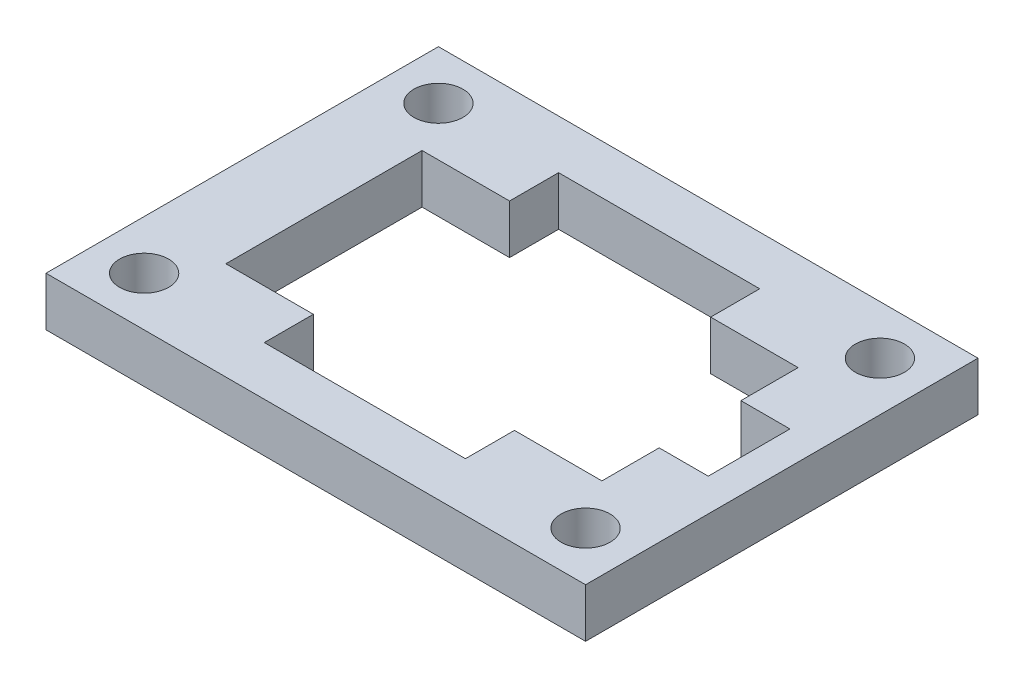
ISO-10303-21;
HEADER;
FILE_DESCRIPTION(('STEP AP214'),'2;1');
FILE_NAME('part.step','',(''),(''),'','','');
FILE_SCHEMA(('AUTOMOTIVE_DESIGN { 1 0 10303 214 1 1 1 1 }'));
ENDSEC;
DATA;
#1=APPLICATION_CONTEXT('core data for automotive mechanical design processes');
#2=APPLICATION_PROTOCOL_DEFINITION('international standard','automotive_design',2000,#1);
#3=PRODUCT_CONTEXT('',#1,'mechanical');
#4=PRODUCT('Part','Part','',(#3));
#5=PRODUCT_RELATED_PRODUCT_CATEGORY('part','',(#4));
#6=PRODUCT_DEFINITION_FORMATION('','',#4);
#7=PRODUCT_DEFINITION_CONTEXT('part definition',#1,'design');
#8=PRODUCT_DEFINITION('design','',#6,#7);
#9=PRODUCT_DEFINITION_SHAPE('','',#8);
#10=(LENGTH_UNIT() NAMED_UNIT(*) SI_UNIT(.MILLI.,.METRE.));
#11=(NAMED_UNIT(*) PLANE_ANGLE_UNIT() SI_UNIT($,.RADIAN.));
#12=(NAMED_UNIT(*) SI_UNIT($,.STERADIAN.) SOLID_ANGLE_UNIT());
#13=UNCERTAINTY_MEASURE_WITH_UNIT(LENGTH_MEASURE(1.E-05),#10,'distance_accuracy_value','');
#14=(GEOMETRIC_REPRESENTATION_CONTEXT(3) GLOBAL_UNCERTAINTY_ASSIGNED_CONTEXT((#13)) GLOBAL_UNIT_ASSIGNED_CONTEXT((#10,
#11,#12)) REPRESENTATION_CONTEXT('',''));
#15=CARTESIAN_POINT('',(0.,0.,0.));
#16=DIRECTION('',(0.,0.,1.));
#17=DIRECTION('',(1.,0.,0.));
#18=AXIS2_PLACEMENT_3D('',#15,#16,#17);
#19=CARTESIAN_POINT('',(0.,3.,0.));
#20=DIRECTION('',(0.,-1.,0.));
#21=DIRECTION('',(0.,0.,-1.));
#22=AXIS2_PLACEMENT_3D('',#19,#20,#21);
#23=PLANE('',#22);
#24=CARTESIAN_POINT('',(3.,3.,-21.));
#25=DIRECTION('',(0.,1.,0.));
#26=DIRECTION('',(0.,0.,1.));
#27=AXIS2_PLACEMENT_3D('',#24,#25,#26);
#28=CIRCLE('',#27,1.5);
#29=CARTESIAN_POINT('',(3.,3.,-19.5));
#30=VERTEX_POINT('',#29);
#31=EDGE_CURVE('E338',#30,#30,#28,.T.);
#32=ORIENTED_EDGE('',*,*,#31,.F.);
#33=EDGE_LOOP('',(#32));
#34=FACE_BOUND('',#33,.T.);
#35=CARTESIAN_POINT('',(3.,3.,-3.));
#36=DIRECTION('',(0.,1.,0.));
#37=DIRECTION('',(0.,0.,1.));
#38=AXIS2_PLACEMENT_3D('',#35,#36,#37);
#39=CIRCLE('',#38,1.5);
#40=CARTESIAN_POINT('',(3.,3.,-1.5));
#41=VERTEX_POINT('',#40);
#42=EDGE_CURVE('E403',#41,#41,#39,.T.);
#43=ORIENTED_EDGE('',*,*,#42,.F.);
#44=EDGE_LOOP('',(#43));
#45=FACE_BOUND('',#44,.T.);
#46=DIRECTION('',(0.,0.,1.));
#47=VECTOR('',#46,1.);
#48=CARTESIAN_POINT('',(0.,3.,0.));
#49=LINE('',#48,#47);
#50=CARTESIAN_POINT('',(0.,3.,-24.));
#51=VERTEX_POINT('',#50);
#52=CARTESIAN_POINT('',(0.,3.,0.));
#53=VERTEX_POINT('',#52);
#54=EDGE_CURVE('E417',#51,#53,#49,.T.);
#55=ORIENTED_EDGE('',*,*,#54,.T.);
#56=DIRECTION('',(1.,0.,0.));
#57=VECTOR('',#56,1.);
#58=CARTESIAN_POINT('',(0.,3.,0.));
#59=LINE('',#58,#57);
#60=CARTESIAN_POINT('',(33.,3.,0.));
#61=VERTEX_POINT('',#60);
#62=EDGE_CURVE('E420',#53,#61,#59,.T.);
#63=ORIENTED_EDGE('',*,*,#62,.T.);
#64=DIRECTION('',(0.,0.,-1.));
#65=VECTOR('',#64,1.);
#66=CARTESIAN_POINT('',(33.,3.,0.));
#67=LINE('',#66,#65);
#68=CARTESIAN_POINT('',(33.,3.,-24.));
#69=VERTEX_POINT('',#68);
#70=EDGE_CURVE('E423',#61,#69,#67,.T.);
#71=ORIENTED_EDGE('',*,*,#70,.T.);
#72=DIRECTION('',(-1.,0.,0.));
#73=VECTOR('',#72,1.);
#74=CARTESIAN_POINT('',(0.,3.,-24.));
#75=LINE('',#74,#73);
#76=EDGE_CURVE('E425',#69,#51,#75,.T.);
#77=ORIENTED_EDGE('',*,*,#76,.T.);
#78=EDGE_LOOP('',(#55,#63,#71,#77));
#79=FACE_BOUND('',#78,.T.);
#80=CARTESIAN_POINT('',(30.,3.,-21.));
#81=DIRECTION('',(0.,1.,0.));
#82=DIRECTION('',(0.,0.,1.));
#83=AXIS2_PLACEMENT_3D('',#80,#81,#82);
#84=CIRCLE('',#83,1.5);
#85=CARTESIAN_POINT('',(30.,3.,-19.5));
#86=VERTEX_POINT('',#85);
#87=EDGE_CURVE('E389',#86,#86,#84,.T.);
#88=ORIENTED_EDGE('',*,*,#87,.F.);
#89=EDGE_LOOP('',(#88));
#90=FACE_BOUND('',#89,.T.);
#91=CARTESIAN_POINT('',(30.,3.,-3.));
#92=DIRECTION('',(0.,1.,0.));
#93=DIRECTION('',(0.,0.,1.));
#94=AXIS2_PLACEMENT_3D('',#91,#92,#93);
#95=CIRCLE('',#94,1.5);
#96=CARTESIAN_POINT('',(30.,3.,-1.5));
#97=VERTEX_POINT('',#96);
#98=EDGE_CURVE('E345',#97,#97,#95,.T.);
#99=ORIENTED_EDGE('',*,*,#98,.F.);
#100=EDGE_LOOP('',(#99));
#101=FACE_BOUND('',#100,.T.);
#102=DIRECTION('',(1.,0.,0.));
#103=VECTOR('',#102,1.);
#104=CARTESIAN_POINT('',(0.,3.,-21.));
#105=LINE('',#104,#103);
#106=CARTESIAN_POINT('',(10.35,3.,-21.));
#107=VERTEX_POINT('',#106);
#108=CARTESIAN_POINT('',(22.65,3.,-21.));
#109=VERTEX_POINT('',#108);
#110=EDGE_CURVE('E371',#107,#109,#105,.T.);
#111=ORIENTED_EDGE('',*,*,#110,.T.);
#112=DIRECTION('',(0.,0.,-1.));
#113=VECTOR('',#112,1.);
#114=CARTESIAN_POINT('',(22.65,3.,-18.));
#115=LINE('',#114,#113);
#116=CARTESIAN_POINT('',(22.65,3.,-18.));
#117=VERTEX_POINT('',#116);
#118=EDGE_CURVE('E315',#117,#109,#115,.T.);
#119=ORIENTED_EDGE('',*,*,#118,.F.);
#120=DIRECTION('',(1.,0.,0.));
#121=VECTOR('',#120,1.);
#122=CARTESIAN_POINT('',(0.,3.,-18.));
#123=LINE('',#122,#121);
#124=CARTESIAN_POINT('',(28.,3.,-18.));
#125=VERTEX_POINT('',#124);
#126=EDGE_CURVE('E368',#117,#125,#123,.T.);
#127=ORIENTED_EDGE('',*,*,#126,.T.);
#128=DIRECTION('',(0.,0.,1.));
#129=VECTOR('',#128,1.);
#130=CARTESIAN_POINT('',(28.,3.,0.));
#131=LINE('',#130,#129);
#132=CARTESIAN_POINT('',(28.,3.,-14.5));
#133=VERTEX_POINT('',#132);
#134=EDGE_CURVE('E344',#125,#133,#131,.T.);
#135=ORIENTED_EDGE('',*,*,#134,.T.);
#136=DIRECTION('',(1.,0.,0.));
#137=VECTOR('',#136,1.);
#138=CARTESIAN_POINT('',(0.,3.,-14.5));
#139=LINE('',#138,#137);
#140=CARTESIAN_POINT('',(31.,3.,-14.5));
#141=VERTEX_POINT('',#140);
#142=EDGE_CURVE('E352',#133,#141,#139,.T.);
#143=ORIENTED_EDGE('',*,*,#142,.T.);
#144=DIRECTION('',(0.,0.,-1.));
#145=VECTOR('',#144,1.);
#146=CARTESIAN_POINT('',(31.,3.,-14.5));
#147=LINE('',#146,#145);
#148=CARTESIAN_POINT('',(31.,3.,-9.5));
#149=VERTEX_POINT('',#148);
#150=EDGE_CURVE('E306',#149,#141,#147,.T.);
#151=ORIENTED_EDGE('',*,*,#150,.F.);
#152=DIRECTION('',(1.,0.,0.));
#153=VECTOR('',#152,1.);
#154=CARTESIAN_POINT('',(0.,3.,-9.5));
#155=LINE('',#154,#153);
#156=CARTESIAN_POINT('',(28.,3.,-9.5));
#157=VERTEX_POINT('',#156);
#158=EDGE_CURVE('E383',#157,#149,#155,.T.);
#159=ORIENTED_EDGE('',*,*,#158,.F.);
#160=CARTESIAN_POINT('',(28.,3.,-6.));
#161=VERTEX_POINT('',#160);
#162=EDGE_CURVE('E369',#157,#161,#131,.T.);
#163=ORIENTED_EDGE('',*,*,#162,.T.);
#164=DIRECTION('',(1.,0.,0.));
#165=VECTOR('',#164,1.);
#166=CARTESIAN_POINT('',(0.,3.,-6.));
#167=LINE('',#166,#165);
#168=CARTESIAN_POINT('',(22.65,3.,-6.));
#169=VERTEX_POINT('',#168);
#170=EDGE_CURVE('E381',#169,#161,#167,.T.);
#171=ORIENTED_EDGE('',*,*,#170,.F.);
#172=DIRECTION('',(0.,0.,-1.));
#173=VECTOR('',#172,1.);
#174=CARTESIAN_POINT('',(22.65,3.,-6.));
#175=LINE('',#174,#173);
#176=CARTESIAN_POINT('',(22.65,3.,-3.));
#177=VERTEX_POINT('',#176);
#178=EDGE_CURVE('E289',#177,#169,#175,.T.);
#179=ORIENTED_EDGE('',*,*,#178,.F.);
#180=DIRECTION('',(1.,0.,0.));
#181=VECTOR('',#180,1.);
#182=CARTESIAN_POINT('',(0.,3.,-3.));
#183=LINE('',#182,#181);
#184=CARTESIAN_POINT('',(10.35,3.,-3.));
#185=VERTEX_POINT('',#184);
#186=EDGE_CURVE('E380',#185,#177,#183,.T.);
#187=ORIENTED_EDGE('',*,*,#186,.F.);
#188=DIRECTION('',(0.,0.,1.));
#189=VECTOR('',#188,1.);
#190=CARTESIAN_POINT('',(10.35,3.,-6.));
#191=LINE('',#190,#189);
#192=CARTESIAN_POINT('',(10.35,3.,-6.));
#193=VERTEX_POINT('',#192);
#194=EDGE_CURVE('E288',#193,#185,#191,.T.);
#195=ORIENTED_EDGE('',*,*,#194,.F.);
#196=CARTESIAN_POINT('',(5.,3.,-6.));
#197=VERTEX_POINT('',#196);
#198=EDGE_CURVE('E377',#197,#193,#167,.T.);
#199=ORIENTED_EDGE('',*,*,#198,.F.);
#200=DIRECTION('',(0.,0.,1.));
#201=VECTOR('',#200,1.);
#202=CARTESIAN_POINT('',(5.,3.,0.));
#203=LINE('',#202,#201);
#204=CARTESIAN_POINT('',(5.,3.,-18.));
#205=VERTEX_POINT('',#204);
#206=EDGE_CURVE('E374',#205,#197,#203,.T.);
#207=ORIENTED_EDGE('',*,*,#206,.F.);
#208=CARTESIAN_POINT('',(10.35,3.,-18.));
#209=VERTEX_POINT('',#208);
#210=EDGE_CURVE('E372',#205,#209,#123,.T.);
#211=ORIENTED_EDGE('',*,*,#210,.T.);
#212=DIRECTION('',(0.,0.,1.));
#213=VECTOR('',#212,1.);
#214=CARTESIAN_POINT('',(10.35,3.,-18.));
#215=LINE('',#214,#213);
#216=EDGE_CURVE('E322',#107,#209,#215,.T.);
#217=ORIENTED_EDGE('',*,*,#216,.F.);
#218=EDGE_LOOP('',(#111,#119,#127,#135,#143,#151,#159,#163,#171,#179,#187,#195,#199,#207,#211,#217));
#219=FACE_BOUND('',#218,.T.);
#220=ADVANCED_FACE('F135',(#34,#45,#79,#90,#101,#219),#23,.F.);
#221=CARTESIAN_POINT('',(0.,0.,0.));
#222=DIRECTION('',(0.,-1.,0.));
#223=DIRECTION('',(0.,0.,-1.));
#224=AXIS2_PLACEMENT_3D('',#221,#222,#223);
#225=PLANE('',#224);
#226=DIRECTION('',(0.,0.,-1.));
#227=VECTOR('',#226,1.);
#228=CARTESIAN_POINT('',(22.65,0.,-18.));
#229=LINE('',#228,#227);
#230=CARTESIAN_POINT('',(22.65,0.,-18.));
#231=VERTEX_POINT('',#230);
#232=CARTESIAN_POINT('',(22.65,0.,-21.));
#233=VERTEX_POINT('',#232);
#234=EDGE_CURVE('E158',#231,#233,#229,.T.);
#235=ORIENTED_EDGE('',*,*,#234,.T.);
#236=DIRECTION('',(1.,0.,0.));
#237=VECTOR('',#236,1.);
#238=CARTESIAN_POINT('',(0.,0.,-21.));
#239=LINE('',#238,#237);
#240=CARTESIAN_POINT('',(10.35,0.,-21.));
#241=VERTEX_POINT('',#240);
#242=EDGE_CURVE('E355',#241,#233,#239,.T.);
#243=ORIENTED_EDGE('',*,*,#242,.F.);
#244=DIRECTION('',(0.,0.,1.));
#245=VECTOR('',#244,1.);
#246=CARTESIAN_POINT('',(10.35,0.,-18.));
#247=LINE('',#246,#245);
#248=CARTESIAN_POINT('',(10.35,0.,-18.));
#249=VERTEX_POINT('',#248);
#250=EDGE_CURVE('E330',#241,#249,#247,.T.);
#251=ORIENTED_EDGE('',*,*,#250,.T.);
#252=DIRECTION('',(1.,0.,0.));
#253=VECTOR('',#252,1.);
#254=CARTESIAN_POINT('',(0.,0.,-18.));
#255=LINE('',#254,#253);
#256=CARTESIAN_POINT('',(5.,0.,-18.));
#257=VERTEX_POINT('',#256);
#258=EDGE_CURVE('E356',#257,#249,#255,.T.);
#259=ORIENTED_EDGE('',*,*,#258,.F.);
#260=DIRECTION('',(0.,0.,1.));
#261=VECTOR('',#260,1.);
#262=CARTESIAN_POINT('',(5.,0.,0.));
#263=LINE('',#262,#261);
#264=CARTESIAN_POINT('',(5.,0.,-6.));
#265=VERTEX_POINT('',#264);
#266=EDGE_CURVE('E358',#257,#265,#263,.T.);
#267=ORIENTED_EDGE('',*,*,#266,.T.);
#268=DIRECTION('',(1.,0.,0.));
#269=VECTOR('',#268,1.);
#270=CARTESIAN_POINT('',(0.,0.,-6.));
#271=LINE('',#270,#269);
#272=CARTESIAN_POINT('',(10.35,0.,-6.));
#273=VERTEX_POINT('',#272);
#274=EDGE_CURVE('E284',#265,#273,#271,.T.);
#275=ORIENTED_EDGE('',*,*,#274,.T.);
#276=DIRECTION('',(0.,0.,1.));
#277=VECTOR('',#276,1.);
#278=CARTESIAN_POINT('',(10.35,0.,-6.));
#279=LINE('',#278,#277);
#280=CARTESIAN_POINT('',(10.35,0.,-3.));
#281=VERTEX_POINT('',#280);
#282=EDGE_CURVE('E150',#273,#281,#279,.T.);
#283=ORIENTED_EDGE('',*,*,#282,.T.);
#284=DIRECTION('',(1.,0.,0.));
#285=VECTOR('',#284,1.);
#286=CARTESIAN_POINT('',(0.,0.,-3.));
#287=LINE('',#286,#285);
#288=CARTESIAN_POINT('',(22.65,0.,-3.));
#289=VERTEX_POINT('',#288);
#290=EDGE_CURVE('E274',#281,#289,#287,.T.);
#291=ORIENTED_EDGE('',*,*,#290,.T.);
#292=DIRECTION('',(0.,0.,-1.));
#293=VECTOR('',#292,1.);
#294=CARTESIAN_POINT('',(22.65,0.,-6.));
#295=LINE('',#294,#293);
#296=CARTESIAN_POINT('',(22.65,0.,-6.));
#297=VERTEX_POINT('',#296);
#298=EDGE_CURVE('E324',#289,#297,#295,.T.);
#299=ORIENTED_EDGE('',*,*,#298,.T.);
#300=CARTESIAN_POINT('',(28.,0.,-6.));
#301=VERTEX_POINT('',#300);
#302=EDGE_CURVE('E283',#297,#301,#271,.T.);
#303=ORIENTED_EDGE('',*,*,#302,.T.);
#304=DIRECTION('',(0.,0.,1.));
#305=VECTOR('',#304,1.);
#306=CARTESIAN_POINT('',(28.,0.,0.));
#307=LINE('',#306,#305);
#308=CARTESIAN_POINT('',(28.,0.,-9.5));
#309=VERTEX_POINT('',#308);
#310=EDGE_CURVE('E353',#309,#301,#307,.T.);
#311=ORIENTED_EDGE('',*,*,#310,.F.);
#312=DIRECTION('',(1.,0.,0.));
#313=VECTOR('',#312,1.);
#314=CARTESIAN_POINT('',(0.,0.,-9.5));
#315=LINE('',#314,#313);
#316=CARTESIAN_POINT('',(31.,0.,-9.5));
#317=VERTEX_POINT('',#316);
#318=EDGE_CURVE('E361',#309,#317,#315,.T.);
#319=ORIENTED_EDGE('',*,*,#318,.T.);
#320=DIRECTION('',(0.,0.,-1.));
#321=VECTOR('',#320,1.);
#322=CARTESIAN_POINT('',(31.,0.,-14.5));
#323=LINE('',#322,#321);
#324=CARTESIAN_POINT('',(31.,0.,-14.5));
#325=VERTEX_POINT('',#324);
#326=EDGE_CURVE('E302',#317,#325,#323,.T.);
#327=ORIENTED_EDGE('',*,*,#326,.T.);
#328=DIRECTION('',(1.,0.,0.));
#329=VECTOR('',#328,1.);
#330=CARTESIAN_POINT('',(0.,0.,-14.5));
#331=LINE('',#330,#329);
#332=CARTESIAN_POINT('',(28.,0.,-14.5));
#333=VERTEX_POINT('',#332);
#334=EDGE_CURVE('E363',#333,#325,#331,.T.);
#335=ORIENTED_EDGE('',*,*,#334,.F.);
#336=CARTESIAN_POINT('',(28.,0.,-18.));
#337=VERTEX_POINT('',#336);
#338=EDGE_CURVE('E349',#337,#333,#307,.T.);
#339=ORIENTED_EDGE('',*,*,#338,.F.);
#340=EDGE_CURVE('E351',#231,#337,#255,.T.);
#341=ORIENTED_EDGE('',*,*,#340,.F.);
#342=EDGE_LOOP('',(#235,#243,#251,#259,#267,#275,#283,#291,#299,#303,#311,#319,#327,#335,#339,#341));
#343=FACE_BOUND('',#342,.T.);
#344=CARTESIAN_POINT('',(3.,0.,-21.));
#345=DIRECTION('',(0.,1.,0.));
#346=DIRECTION('',(0.,0.,1.));
#347=AXIS2_PLACEMENT_3D('',#344,#345,#346);
#348=CIRCLE('',#347,1.5);
#349=CARTESIAN_POINT('',(3.,0.,-19.5));
#350=VERTEX_POINT('',#349);
#351=EDGE_CURVE('E406',#350,#350,#348,.T.);
#352=ORIENTED_EDGE('',*,*,#351,.T.);
#353=EDGE_LOOP('',(#352));
#354=FACE_BOUND('',#353,.T.);
#355=CARTESIAN_POINT('',(3.,0.,-3.));
#356=DIRECTION('',(0.,1.,0.));
#357=DIRECTION('',(0.,0.,1.));
#358=AXIS2_PLACEMENT_3D('',#355,#356,#357);
#359=CIRCLE('',#358,1.5);
#360=CARTESIAN_POINT('',(3.,0.,-1.5));
#361=VERTEX_POINT('',#360);
#362=EDGE_CURVE('E348',#361,#361,#359,.T.);
#363=ORIENTED_EDGE('',*,*,#362,.T.);
#364=EDGE_LOOP('',(#363));
#365=FACE_BOUND('',#364,.T.);
#366=CARTESIAN_POINT('',(30.,0.,-3.));
#367=DIRECTION('',(0.,1.,0.));
#368=DIRECTION('',(0.,0.,1.));
#369=AXIS2_PLACEMENT_3D('',#366,#367,#368);
#370=CIRCLE('',#369,1.5);
#371=CARTESIAN_POINT('',(30.,0.,-1.5));
#372=VERTEX_POINT('',#371);
#373=EDGE_CURVE('E341',#372,#372,#370,.T.);
#374=ORIENTED_EDGE('',*,*,#373,.T.);
#375=EDGE_LOOP('',(#374));
#376=FACE_BOUND('',#375,.T.);
#377=CARTESIAN_POINT('',(30.,0.,-21.));
#378=DIRECTION('',(0.,1.,0.));
#379=DIRECTION('',(0.,0.,1.));
#380=AXIS2_PLACEMENT_3D('',#377,#378,#379);
#381=CIRCLE('',#380,1.5);
#382=CARTESIAN_POINT('',(30.,0.,-19.5));
#383=VERTEX_POINT('',#382);
#384=EDGE_CURVE('E411',#383,#383,#381,.T.);
#385=ORIENTED_EDGE('',*,*,#384,.T.);
#386=EDGE_LOOP('',(#385));
#387=FACE_BOUND('',#386,.T.);
#388=DIRECTION('',(0.,0.,1.));
#389=VECTOR('',#388,1.);
#390=CARTESIAN_POINT('',(0.,0.,0.));
#391=LINE('',#390,#389);
#392=CARTESIAN_POINT('',(0.,0.,-24.));
#393=VERTEX_POINT('',#392);
#394=CARTESIAN_POINT('',(0.,0.,0.));
#395=VERTEX_POINT('',#394);
#396=EDGE_CURVE('E414',#393,#395,#391,.T.);
#397=ORIENTED_EDGE('',*,*,#396,.F.);
#398=DIRECTION('',(-1.,0.,0.));
#399=VECTOR('',#398,1.);
#400=CARTESIAN_POINT('',(0.,0.,-24.));
#401=LINE('',#400,#399);
#402=CARTESIAN_POINT('',(33.,0.,-24.));
#403=VERTEX_POINT('',#402);
#404=EDGE_CURVE('E421',#403,#393,#401,.T.);
#405=ORIENTED_EDGE('',*,*,#404,.F.);
#406=DIRECTION('',(0.,0.,-1.));
#407=VECTOR('',#406,1.);
#408=CARTESIAN_POINT('',(33.,0.,0.));
#409=LINE('',#408,#407);
#410=CARTESIAN_POINT('',(33.,0.,0.));
#411=VERTEX_POINT('',#410);
#412=EDGE_CURVE('E432',#411,#403,#409,.T.);
#413=ORIENTED_EDGE('',*,*,#412,.F.);
#414=DIRECTION('',(1.,0.,0.));
#415=VECTOR('',#414,1.);
#416=CARTESIAN_POINT('',(0.,0.,0.));
#417=LINE('',#416,#415);
#418=EDGE_CURVE('E430',#395,#411,#417,.T.);
#419=ORIENTED_EDGE('',*,*,#418,.F.);
#420=EDGE_LOOP('',(#397,#405,#413,#419));
#421=FACE_BOUND('',#420,.T.);
#422=ADVANCED_FACE('F293',(#343,#354,#365,#376,#387,#421),#225,.T.);
#423=CARTESIAN_POINT('',(0.,3.,0.));
#424=DIRECTION('',(1.,0.,0.));
#425=DIRECTION('',(0.,0.,-1.));
#426=AXIS2_PLACEMENT_3D('',#423,#424,#425);
#427=PLANE('',#426);
#428=ORIENTED_EDGE('',*,*,#396,.T.);
#429=DIRECTION('',(0.,-1.,0.));
#430=VECTOR('',#429,1.);
#431=CARTESIAN_POINT('',(0.,3.,0.));
#432=LINE('',#431,#430);
#433=EDGE_CURVE('E12',#53,#395,#432,.T.);
#434=ORIENTED_EDGE('',*,*,#433,.F.);
#435=ORIENTED_EDGE('',*,*,#54,.F.);
#436=DIRECTION('',(0.,-1.,0.));
#437=VECTOR('',#436,1.);
#438=CARTESIAN_POINT('',(0.,3.,-24.));
#439=LINE('',#438,#437);
#440=EDGE_CURVE('E427',#51,#393,#439,.T.);
#441=ORIENTED_EDGE('',*,*,#440,.T.);
#442=EDGE_LOOP('',(#428,#434,#435,#441));
#443=FACE_BOUND('',#442,.T.);
#444=ADVANCED_FACE('F137',(#443),#427,.F.);
#445=CARTESIAN_POINT('',(0.,3.,0.));
#446=DIRECTION('',(0.,0.,-1.));
#447=DIRECTION('',(-1.,0.,0.));
#448=AXIS2_PLACEMENT_3D('',#445,#446,#447);
#449=PLANE('',#448);
#450=ORIENTED_EDGE('',*,*,#418,.T.);
#451=DIRECTION('',(0.,-1.,0.));
#452=VECTOR('',#451,1.);
#453=CARTESIAN_POINT('',(33.,3.,0.));
#454=LINE('',#453,#452);
#455=EDGE_CURVE('E143',#61,#411,#454,.T.);
#456=ORIENTED_EDGE('',*,*,#455,.F.);
#457=ORIENTED_EDGE('',*,*,#62,.F.);
#458=ORIENTED_EDGE('',*,*,#433,.T.);
#459=EDGE_LOOP('',(#450,#456,#457,#458));
#460=FACE_BOUND('',#459,.T.);
#461=ADVANCED_FACE('F459',(#460),#449,.F.);
#462=CARTESIAN_POINT('',(33.,3.,0.));
#463=DIRECTION('',(-1.,0.,0.));
#464=DIRECTION('',(0.,0.,1.));
#465=AXIS2_PLACEMENT_3D('',#462,#463,#464);
#466=PLANE('',#465);
#467=ORIENTED_EDGE('',*,*,#412,.T.);
#468=DIRECTION('',(0.,-1.,0.));
#469=VECTOR('',#468,1.);
#470=CARTESIAN_POINT('',(33.,3.,-24.));
#471=LINE('',#470,#469);
#472=EDGE_CURVE('E437',#69,#403,#471,.T.);
#473=ORIENTED_EDGE('',*,*,#472,.F.);
#474=ORIENTED_EDGE('',*,*,#70,.F.);
#475=ORIENTED_EDGE('',*,*,#455,.T.);
#476=EDGE_LOOP('',(#467,#473,#474,#475));
#477=FACE_BOUND('',#476,.T.);
#478=ADVANCED_FACE('F444',(#477),#466,.F.);
#479=CARTESIAN_POINT('',(0.,3.,-24.));
#480=DIRECTION('',(0.,0.,1.));
#481=DIRECTION('',(1.,0.,0.));
#482=AXIS2_PLACEMENT_3D('',#479,#480,#481);
#483=PLANE('',#482);
#484=ORIENTED_EDGE('',*,*,#404,.T.);
#485=ORIENTED_EDGE('',*,*,#440,.F.);
#486=ORIENTED_EDGE('',*,*,#76,.F.);
#487=ORIENTED_EDGE('',*,*,#472,.T.);
#488=EDGE_LOOP('',(#484,#485,#486,#487));
#489=FACE_BOUND('',#488,.T.);
#490=ADVANCED_FACE('F452',(#489),#483,.F.);
#491=CARTESIAN_POINT('',(30.,0.,-21.));
#492=DIRECTION('',(0.,1.,0.));
#493=DIRECTION('',(0.,0.,1.));
#494=AXIS2_PLACEMENT_3D('',#491,#492,#493);
#495=CYLINDRICAL_SURFACE('',#494,1.5);
#496=ORIENTED_EDGE('',*,*,#384,.F.);
#497=EDGE_LOOP('',(#496));
#498=FACE_BOUND('',#497,.T.);
#499=ORIENTED_EDGE('',*,*,#87,.T.);
#500=EDGE_LOOP('',(#499));
#501=FACE_BOUND('',#500,.T.);
#502=ADVANCED_FACE('F476',(#498,#501),#495,.F.);
#503=CARTESIAN_POINT('',(30.,0.,-3.));
#504=DIRECTION('',(0.,1.,0.));
#505=DIRECTION('',(0.,0.,1.));
#506=AXIS2_PLACEMENT_3D('',#503,#504,#505);
#507=CYLINDRICAL_SURFACE('',#506,1.5);
#508=ORIENTED_EDGE('',*,*,#373,.F.);
#509=EDGE_LOOP('',(#508));
#510=FACE_BOUND('',#509,.T.);
#511=ORIENTED_EDGE('',*,*,#98,.T.);
#512=EDGE_LOOP('',(#511));
#513=FACE_BOUND('',#512,.T.);
#514=ADVANCED_FACE('F483',(#510,#513),#507,.F.);
#515=CARTESIAN_POINT('',(28.,0.,0.));
#516=DIRECTION('',(-1.,0.,0.));
#517=DIRECTION('',(0.,0.,1.));
#518=AXIS2_PLACEMENT_3D('',#515,#516,#517);
#519=PLANE('',#518);
#520=ORIENTED_EDGE('',*,*,#134,.F.);
#521=DIRECTION('',(0.,1.,0.));
#522=VECTOR('',#521,1.);
#523=CARTESIAN_POINT('',(28.,0.,-18.));
#524=LINE('',#523,#522);
#525=EDGE_CURVE('E365',#337,#125,#524,.T.);
#526=ORIENTED_EDGE('',*,*,#525,.F.);
#527=ORIENTED_EDGE('',*,*,#338,.T.);
#528=DIRECTION('',(0.,1.,0.));
#529=VECTOR('',#528,1.);
#530=CARTESIAN_POINT('',(28.,0.,-14.5));
#531=LINE('',#530,#529);
#532=EDGE_CURVE('E386',#333,#133,#531,.T.);
#533=ORIENTED_EDGE('',*,*,#532,.T.);
#534=EDGE_LOOP('',(#520,#526,#527,#533));
#535=FACE_BOUND('',#534,.T.);
#536=ADVANCED_FACE('F488',(#535),#519,.T.);
#537=CARTESIAN_POINT('',(0.,0.,-14.5));
#538=DIRECTION('',(0.,0.,1.));
#539=DIRECTION('',(1.,0.,0.));
#540=AXIS2_PLACEMENT_3D('',#537,#538,#539);
#541=PLANE('',#540);
#542=ORIENTED_EDGE('',*,*,#142,.F.);
#543=ORIENTED_EDGE('',*,*,#532,.F.);
#544=ORIENTED_EDGE('',*,*,#334,.T.);
#545=DIRECTION('',(0.,1.,0.));
#546=VECTOR('',#545,1.);
#547=CARTESIAN_POINT('',(31.,0.,-14.5));
#548=LINE('',#547,#546);
#549=EDGE_CURVE('E299',#325,#141,#548,.T.);
#550=ORIENTED_EDGE('',*,*,#549,.T.);
#551=EDGE_LOOP('',(#542,#543,#544,#550));
#552=FACE_BOUND('',#551,.T.);
#553=ADVANCED_FACE('F515',(#552),#541,.T.);
#554=CARTESIAN_POINT('',(0.,0.,-9.5));
#555=DIRECTION('',(0.,0.,1.));
#556=DIRECTION('',(1.,0.,0.));
#557=AXIS2_PLACEMENT_3D('',#554,#555,#556);
#558=PLANE('',#557);
#559=ORIENTED_EDGE('',*,*,#158,.T.);
#560=DIRECTION('',(0.,1.,0.));
#561=VECTOR('',#560,1.);
#562=CARTESIAN_POINT('',(31.,0.,-9.5));
#563=LINE('',#562,#561);
#564=EDGE_CURVE('E305',#317,#149,#563,.T.);
#565=ORIENTED_EDGE('',*,*,#564,.F.);
#566=ORIENTED_EDGE('',*,*,#318,.F.);
#567=DIRECTION('',(0.,1.,0.));
#568=VECTOR('',#567,1.);
#569=CARTESIAN_POINT('',(28.,0.,-9.5));
#570=LINE('',#569,#568);
#571=EDGE_CURVE('E390',#309,#157,#570,.T.);
#572=ORIENTED_EDGE('',*,*,#571,.T.);
#573=EDGE_LOOP('',(#559,#565,#566,#572));
#574=FACE_BOUND('',#573,.T.);
#575=ADVANCED_FACE('F526',(#574),#558,.F.);
#576=ORIENTED_EDGE('',*,*,#162,.F.);
#577=ORIENTED_EDGE('',*,*,#571,.F.);
#578=ORIENTED_EDGE('',*,*,#310,.T.);
#579=DIRECTION('',(0.,1.,0.));
#580=VECTOR('',#579,1.);
#581=CARTESIAN_POINT('',(28.,0.,-6.));
#582=LINE('',#581,#580);
#583=EDGE_CURVE('E392',#301,#161,#582,.T.);
#584=ORIENTED_EDGE('',*,*,#583,.T.);
#585=EDGE_LOOP('',(#576,#577,#578,#584));
#586=FACE_BOUND('',#585,.T.);
#587=ADVANCED_FACE('F531',(#586),#519,.T.);
#588=CARTESIAN_POINT('',(0.,0.,-6.));
#589=DIRECTION('',(0.,0.,1.));
#590=DIRECTION('',(1.,0.,0.));
#591=AXIS2_PLACEMENT_3D('',#588,#589,#590);
#592=PLANE('',#591);
#593=ORIENTED_EDGE('',*,*,#302,.F.);
#594=DIRECTION('',(0.,1.,0.));
#595=VECTOR('',#594,1.);
#596=CARTESIAN_POINT('',(22.65,0.,-6.));
#597=LINE('',#596,#595);
#598=EDGE_CURVE('E318',#297,#169,#597,.T.);
#599=ORIENTED_EDGE('',*,*,#598,.T.);
#600=ORIENTED_EDGE('',*,*,#170,.T.);
#601=ORIENTED_EDGE('',*,*,#583,.F.);
#602=EDGE_LOOP('',(#593,#599,#600,#601));
#603=FACE_BOUND('',#602,.T.);
#604=ADVANCED_FACE('F536',(#603),#592,.F.);
#605=CARTESIAN_POINT('',(0.,0.,-3.));
#606=DIRECTION('',(0.,0.,1.));
#607=DIRECTION('',(1.,0.,0.));
#608=AXIS2_PLACEMENT_3D('',#605,#606,#607);
#609=PLANE('',#608);
#610=ORIENTED_EDGE('',*,*,#186,.T.);
#611=DIRECTION('',(0.,1.,0.));
#612=VECTOR('',#611,1.);
#613=CARTESIAN_POINT('',(22.65,0.,-3.));
#614=LINE('',#613,#612);
#615=EDGE_CURVE('E279',#289,#177,#614,.T.);
#616=ORIENTED_EDGE('',*,*,#615,.F.);
#617=ORIENTED_EDGE('',*,*,#290,.F.);
#618=DIRECTION('',(0.,1.,0.));
#619=VECTOR('',#618,1.);
#620=CARTESIAN_POINT('',(10.35,0.,-3.));
#621=LINE('',#620,#619);
#622=EDGE_CURVE('E276',#281,#185,#621,.T.);
#623=ORIENTED_EDGE('',*,*,#622,.T.);
#624=EDGE_LOOP('',(#610,#616,#617,#623));
#625=FACE_BOUND('',#624,.T.);
#626=ADVANCED_FACE('F275',(#625),#609,.F.);
#627=ORIENTED_EDGE('',*,*,#198,.T.);
#628=DIRECTION('',(0.,1.,0.));
#629=VECTOR('',#628,1.);
#630=CARTESIAN_POINT('',(10.35,0.,-6.));
#631=LINE('',#630,#629);
#632=EDGE_CURVE('E290',#273,#193,#631,.T.);
#633=ORIENTED_EDGE('',*,*,#632,.F.);
#634=ORIENTED_EDGE('',*,*,#274,.F.);
#635=DIRECTION('',(0.,1.,0.));
#636=VECTOR('',#635,1.);
#637=CARTESIAN_POINT('',(5.,0.,-6.));
#638=LINE('',#637,#636);
#639=EDGE_CURVE('E395',#265,#197,#638,.T.);
#640=ORIENTED_EDGE('',*,*,#639,.T.);
#641=EDGE_LOOP('',(#627,#633,#634,#640));
#642=FACE_BOUND('',#641,.T.);
#643=ADVANCED_FACE('F562',(#642),#592,.F.);
#644=CARTESIAN_POINT('',(5.,0.,0.));
#645=DIRECTION('',(-1.,0.,0.));
#646=DIRECTION('',(0.,0.,1.));
#647=AXIS2_PLACEMENT_3D('',#644,#645,#646);
#648=PLANE('',#647);
#649=ORIENTED_EDGE('',*,*,#206,.T.);
#650=ORIENTED_EDGE('',*,*,#639,.F.);
#651=ORIENTED_EDGE('',*,*,#266,.F.);
#652=DIRECTION('',(0.,1.,0.));
#653=VECTOR('',#652,1.);
#654=CARTESIAN_POINT('',(5.,0.,-18.));
#655=LINE('',#654,#653);
#656=EDGE_CURVE('E397',#257,#205,#655,.T.);
#657=ORIENTED_EDGE('',*,*,#656,.T.);
#658=EDGE_LOOP('',(#649,#650,#651,#657));
#659=FACE_BOUND('',#658,.T.);
#660=ADVANCED_FACE('F565',(#659),#648,.F.);
#661=CARTESIAN_POINT('',(0.,0.,-18.));
#662=DIRECTION('',(0.,0.,1.));
#663=DIRECTION('',(1.,0.,0.));
#664=AXIS2_PLACEMENT_3D('',#661,#662,#663);
#665=PLANE('',#664);
#666=DIRECTION('',(0.,1.,0.));
#667=VECTOR('',#666,1.);
#668=CARTESIAN_POINT('',(10.35,0.,-18.));
#669=LINE('',#668,#667);
#670=EDGE_CURVE('E335',#249,#209,#669,.T.);
#671=ORIENTED_EDGE('',*,*,#670,.T.);
#672=ORIENTED_EDGE('',*,*,#210,.F.);
#673=ORIENTED_EDGE('',*,*,#656,.F.);
#674=ORIENTED_EDGE('',*,*,#258,.T.);
#675=EDGE_LOOP('',(#671,#672,#673,#674));
#676=FACE_BOUND('',#675,.T.);
#677=ADVANCED_FACE('F568',(#676),#665,.T.);
#678=CARTESIAN_POINT('',(0.,0.,-21.));
#679=DIRECTION('',(0.,0.,1.));
#680=DIRECTION('',(1.,0.,0.));
#681=AXIS2_PLACEMENT_3D('',#678,#679,#680);
#682=PLANE('',#681);
#683=ORIENTED_EDGE('',*,*,#110,.F.);
#684=DIRECTION('',(0.,1.,0.));
#685=VECTOR('',#684,1.);
#686=CARTESIAN_POINT('',(10.35,0.,-21.));
#687=LINE('',#686,#685);
#688=EDGE_CURVE('E333',#241,#107,#687,.T.);
#689=ORIENTED_EDGE('',*,*,#688,.F.);
#690=ORIENTED_EDGE('',*,*,#242,.T.);
#691=DIRECTION('',(0.,1.,0.));
#692=VECTOR('',#691,1.);
#693=CARTESIAN_POINT('',(22.65,0.,-21.));
#694=LINE('',#693,#692);
#695=EDGE_CURVE('E319',#233,#109,#694,.T.);
#696=ORIENTED_EDGE('',*,*,#695,.T.);
#697=EDGE_LOOP('',(#683,#689,#690,#696));
#698=FACE_BOUND('',#697,.T.);
#699=ADVANCED_FACE('F503',(#698),#682,.T.);
#700=DIRECTION('',(0.,1.,0.));
#701=VECTOR('',#700,1.);
#702=CARTESIAN_POINT('',(22.65,0.,-18.));
#703=LINE('',#702,#701);
#704=EDGE_CURVE('E314',#231,#117,#703,.T.);
#705=ORIENTED_EDGE('',*,*,#704,.F.);
#706=ORIENTED_EDGE('',*,*,#340,.T.);
#707=ORIENTED_EDGE('',*,*,#525,.T.);
#708=ORIENTED_EDGE('',*,*,#126,.F.);
#709=EDGE_LOOP('',(#705,#706,#707,#708));
#710=FACE_BOUND('',#709,.T.);
#711=ADVANCED_FACE('F507',(#710),#665,.T.);
#712=CARTESIAN_POINT('',(3.,0.,-3.));
#713=DIRECTION('',(0.,1.,0.));
#714=DIRECTION('',(0.,0.,1.));
#715=AXIS2_PLACEMENT_3D('',#712,#713,#714);
#716=CYLINDRICAL_SURFACE('',#715,1.5);
#717=ORIENTED_EDGE('',*,*,#362,.F.);
#718=EDGE_LOOP('',(#717));
#719=FACE_BOUND('',#718,.T.);
#720=ORIENTED_EDGE('',*,*,#42,.T.);
#721=EDGE_LOOP('',(#720));
#722=FACE_BOUND('',#721,.T.);
#723=ADVANCED_FACE('F575',(#719,#722),#716,.F.);
#724=CARTESIAN_POINT('',(3.,0.,-21.));
#725=DIRECTION('',(0.,1.,0.));
#726=DIRECTION('',(0.,0.,1.));
#727=AXIS2_PLACEMENT_3D('',#724,#725,#726);
#728=CYLINDRICAL_SURFACE('',#727,1.5);
#729=ORIENTED_EDGE('',*,*,#351,.F.);
#730=EDGE_LOOP('',(#729));
#731=FACE_BOUND('',#730,.T.);
#732=ORIENTED_EDGE('',*,*,#31,.T.);
#733=EDGE_LOOP('',(#732));
#734=FACE_BOUND('',#733,.T.);
#735=ADVANCED_FACE('F577',(#731,#734),#728,.F.);
#736=CARTESIAN_POINT('',(22.65,0.,-18.));
#737=DIRECTION('',(1.,0.,0.));
#738=DIRECTION('',(0.,0.,-1.));
#739=AXIS2_PLACEMENT_3D('',#736,#737,#738);
#740=PLANE('',#739);
#741=ORIENTED_EDGE('',*,*,#118,.T.);
#742=ORIENTED_EDGE('',*,*,#695,.F.);
#743=ORIENTED_EDGE('',*,*,#234,.F.);
#744=ORIENTED_EDGE('',*,*,#704,.T.);
#745=EDGE_LOOP('',(#741,#742,#743,#744));
#746=FACE_BOUND('',#745,.T.);
#747=ADVANCED_FACE('F504',(#746),#740,.F.);
#748=CARTESIAN_POINT('',(10.35,0.,-18.));
#749=DIRECTION('',(-1.,0.,0.));
#750=DIRECTION('',(0.,0.,1.));
#751=AXIS2_PLACEMENT_3D('',#748,#749,#750);
#752=PLANE('',#751);
#753=ORIENTED_EDGE('',*,*,#216,.T.);
#754=ORIENTED_EDGE('',*,*,#670,.F.);
#755=ORIENTED_EDGE('',*,*,#250,.F.);
#756=ORIENTED_EDGE('',*,*,#688,.T.);
#757=EDGE_LOOP('',(#753,#754,#755,#756));
#758=FACE_BOUND('',#757,.T.);
#759=ADVANCED_FACE('F547',(#758),#752,.F.);
#760=CARTESIAN_POINT('',(10.35,0.,-6.));
#761=DIRECTION('',(-1.,0.,0.));
#762=DIRECTION('',(0.,0.,1.));
#763=AXIS2_PLACEMENT_3D('',#760,#761,#762);
#764=PLANE('',#763);
#765=ORIENTED_EDGE('',*,*,#194,.T.);
#766=ORIENTED_EDGE('',*,*,#622,.F.);
#767=ORIENTED_EDGE('',*,*,#282,.F.);
#768=ORIENTED_EDGE('',*,*,#632,.T.);
#769=EDGE_LOOP('',(#765,#766,#767,#768));
#770=FACE_BOUND('',#769,.T.);
#771=ADVANCED_FACE('F286',(#770),#764,.F.);
#772=CARTESIAN_POINT('',(22.65,0.,-6.));
#773=DIRECTION('',(1.,0.,0.));
#774=DIRECTION('',(0.,0.,-1.));
#775=AXIS2_PLACEMENT_3D('',#772,#773,#774);
#776=PLANE('',#775);
#777=ORIENTED_EDGE('',*,*,#178,.T.);
#778=ORIENTED_EDGE('',*,*,#598,.F.);
#779=ORIENTED_EDGE('',*,*,#298,.F.);
#780=ORIENTED_EDGE('',*,*,#615,.T.);
#781=EDGE_LOOP('',(#777,#778,#779,#780));
#782=FACE_BOUND('',#781,.T.);
#783=ADVANCED_FACE('F539',(#782),#776,.F.);
#784=CARTESIAN_POINT('',(31.,0.,-14.5));
#785=DIRECTION('',(1.,0.,0.));
#786=DIRECTION('',(0.,0.,-1.));
#787=AXIS2_PLACEMENT_3D('',#784,#785,#786);
#788=PLANE('',#787);
#789=ORIENTED_EDGE('',*,*,#150,.T.);
#790=ORIENTED_EDGE('',*,*,#549,.F.);
#791=ORIENTED_EDGE('',*,*,#326,.F.);
#792=ORIENTED_EDGE('',*,*,#564,.T.);
#793=EDGE_LOOP('',(#789,#790,#791,#792));
#794=FACE_BOUND('',#793,.T.);
#795=ADVANCED_FACE('F521',(#794),#788,.F.);
#796=CLOSED_SHELL('',(#220,#422,#444,#461,#478,#490,#502,#514,#536,#553,#575,#587,#604,#626,
#643,#660,#677,#699,#711,#723,#735,#747,#759,#771,#783,#795));
#797=MANIFOLD_SOLID_BREP('B2',#796);
#798=ADVANCED_BREP_SHAPE_REPRESENTATION('',(#18,#797),#14);
#799=SHAPE_DEFINITION_REPRESENTATION(#9,#798);
ENDSEC;
END-ISO-10303-21;
